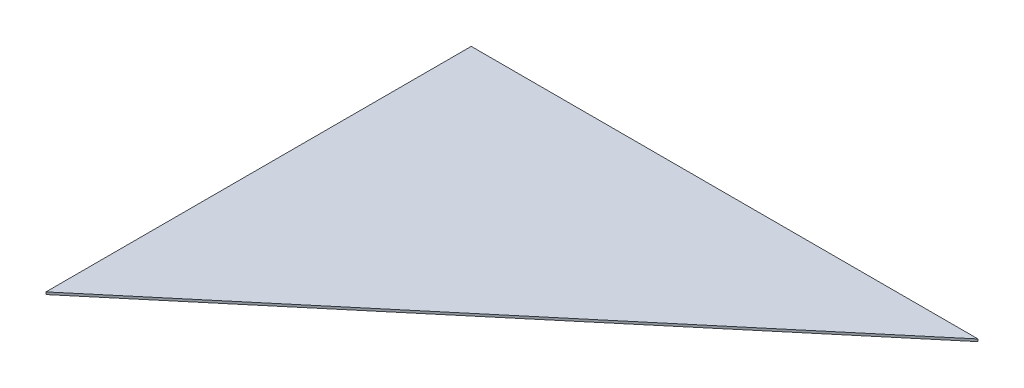
ISO-10303-21;
HEADER;
FILE_DESCRIPTION(('STEP AP214'),'2;1');
FILE_NAME('part.step','',(''),(''),'','','');
FILE_SCHEMA(('AUTOMOTIVE_DESIGN { 1 0 10303 214 1 1 1 1 }'));
ENDSEC;
DATA;
#1=APPLICATION_CONTEXT('core data for automotive mechanical design processes');
#2=APPLICATION_PROTOCOL_DEFINITION('international standard','automotive_design',2000,#1);
#3=PRODUCT_CONTEXT('',#1,'mechanical');
#4=PRODUCT('Part','Part','',(#3));
#5=PRODUCT_RELATED_PRODUCT_CATEGORY('part','',(#4));
#6=PRODUCT_DEFINITION_FORMATION('','',#4);
#7=PRODUCT_DEFINITION_CONTEXT('part definition',#1,'design');
#8=PRODUCT_DEFINITION('design','',#6,#7);
#9=PRODUCT_DEFINITION_SHAPE('','',#8);
#10=(LENGTH_UNIT() NAMED_UNIT(*) SI_UNIT(.MILLI.,.METRE.));
#11=(NAMED_UNIT(*) PLANE_ANGLE_UNIT() SI_UNIT($,.RADIAN.));
#12=(NAMED_UNIT(*) SI_UNIT($,.STERADIAN.) SOLID_ANGLE_UNIT());
#13=UNCERTAINTY_MEASURE_WITH_UNIT(LENGTH_MEASURE(1.E-05),#10,'distance_accuracy_value','');
#14=(GEOMETRIC_REPRESENTATION_CONTEXT(3) GLOBAL_UNCERTAINTY_ASSIGNED_CONTEXT((#13)) GLOBAL_UNIT_ASSIGNED_CONTEXT((#10,
#11,#12)) REPRESENTATION_CONTEXT('',''));
#15=CARTESIAN_POINT('',(0.,0.,0.));
#16=DIRECTION('',(0.,0.,1.));
#17=DIRECTION('',(1.,0.,0.));
#18=AXIS2_PLACEMENT_3D('',#15,#16,#17);
#19=CARTESIAN_POINT('',(553.75474691391,-6.35,574.675));
#20=DIRECTION('',(-1.,0.,0.));
#21=DIRECTION('',(0.,0.,1.));
#22=AXIS2_PLACEMENT_3D('',#19,#20,#21);
#23=PLANE('',#22);
#24=DIRECTION('',(0.,0.,1.));
#25=VECTOR('',#24,1.);
#26=CARTESIAN_POINT('',(553.75474691391,0.,574.675));
#27=LINE('',#26,#25);
#28=CARTESIAN_POINT('',(553.75474691391,0.,0.));
#29=VERTEX_POINT('',#28);
#30=CARTESIAN_POINT('',(553.75474691391,0.,1149.35));
#31=VERTEX_POINT('',#30);
#32=EDGE_CURVE('E60',#29,#31,#27,.T.);
#33=ORIENTED_EDGE('',*,*,#32,.F.);
#34=DIRECTION('',(0.,1.,0.));
#35=VECTOR('',#34,1.);
#36=CARTESIAN_POINT('',(553.75474691391,-6.35,0.));
#37=LINE('',#36,#35);
#38=CARTESIAN_POINT('',(553.75474691391,-6.35,0.));
#39=VERTEX_POINT('',#38);
#40=EDGE_CURVE('E9',#39,#29,#37,.T.);
#41=ORIENTED_EDGE('',*,*,#40,.F.);
#42=DIRECTION('',(0.,0.,1.));
#43=VECTOR('',#42,1.);
#44=CARTESIAN_POINT('',(553.75474691391,-6.35,574.675));
#45=LINE('',#44,#43);
#46=CARTESIAN_POINT('',(553.75474691391,-6.35,1149.35));
#47=VERTEX_POINT('',#46);
#48=EDGE_CURVE('E58',#39,#47,#45,.T.);
#49=ORIENTED_EDGE('',*,*,#48,.T.);
#50=DIRECTION('',(0.,1.,0.));
#51=VECTOR('',#50,1.);
#52=CARTESIAN_POINT('',(553.75474691391,-6.35,1149.35));
#53=LINE('',#52,#51);
#54=EDGE_CURVE('E36',#47,#31,#53,.T.);
#55=ORIENTED_EDGE('',*,*,#54,.T.);
#56=EDGE_LOOP('',(#33,#41,#49,#55));
#57=FACE_BOUND('',#56,.T.);
#58=ADVANCED_FACE('F14',(#57),#23,.T.);
#59=CARTESIAN_POINT('',(1238.62574273799,-6.35,0.));
#60=DIRECTION('',(0.,0.,-1.));
#61=DIRECTION('',(-1.,0.,0.));
#62=AXIS2_PLACEMENT_3D('',#59,#60,#61);
#63=PLANE('',#62);
#64=DIRECTION('',(-1.,0.,0.));
#65=VECTOR('',#64,1.);
#66=CARTESIAN_POINT('',(1238.62574273799,0.,0.));
#67=LINE('',#66,#65);
#68=CARTESIAN_POINT('',(1923.49673856207,0.,-2.20388805938073E-13));
#69=VERTEX_POINT('',#68);
#70=EDGE_CURVE('E83',#69,#29,#67,.T.);
#71=ORIENTED_EDGE('',*,*,#70,.F.);
#72=DIRECTION('',(0.,1.,0.));
#73=VECTOR('',#72,1.);
#74=CARTESIAN_POINT('',(1923.49673856207,-6.35,-2.20388805938073E-13));
#75=LINE('',#74,#73);
#76=CARTESIAN_POINT('',(1923.49673856207,-6.35,-2.20388805938073E-13));
#77=VERTEX_POINT('',#76);
#78=EDGE_CURVE('E23',#77,#69,#75,.T.);
#79=ORIENTED_EDGE('',*,*,#78,.F.);
#80=DIRECTION('',(-1.,0.,0.));
#81=VECTOR('',#80,1.);
#82=CARTESIAN_POINT('',(1238.62574273799,-6.35,0.));
#83=LINE('',#82,#81);
#84=EDGE_CURVE('E67',#77,#39,#83,.T.);
#85=ORIENTED_EDGE('',*,*,#84,.T.);
#86=ORIENTED_EDGE('',*,*,#40,.T.);
#87=EDGE_LOOP('',(#71,#79,#85,#86));
#88=FACE_BOUND('',#87,.T.);
#89=ADVANCED_FACE('F72',(#88),#63,.T.);
#90=CARTESIAN_POINT('',(1238.62574273799,-6.35,574.675));
#91=DIRECTION('',(0.642787609686539,0.,0.766044443118978));
#92=DIRECTION('',(0.766044443118978,0.,-0.642787609686539));
#93=AXIS2_PLACEMENT_3D('',#90,#91,#92);
#94=PLANE('',#93);
#95=DIRECTION('',(0.766044443118978,0.,-0.642787609686539));
#96=VECTOR('',#95,1.);
#97=CARTESIAN_POINT('',(1238.62574273799,0.,574.675));
#98=LINE('',#97,#96);
#99=EDGE_CURVE('E70',#31,#69,#98,.T.);
#100=ORIENTED_EDGE('',*,*,#99,.F.);
#101=ORIENTED_EDGE('',*,*,#54,.F.);
#102=DIRECTION('',(0.766044443118978,0.,-0.642787609686539));
#103=VECTOR('',#102,1.);
#104=CARTESIAN_POINT('',(1238.62574273799,-6.35,574.675));
#105=LINE('',#104,#103);
#106=EDGE_CURVE('E68',#47,#77,#105,.T.);
#107=ORIENTED_EDGE('',*,*,#106,.T.);
#108=ORIENTED_EDGE('',*,*,#78,.T.);
#109=EDGE_LOOP('',(#100,#101,#107,#108));
#110=FACE_BOUND('',#109,.T.);
#111=ADVANCED_FACE('F103',(#110),#94,.T.);
#112=CARTESIAN_POINT('',(1238.62574273799,-6.35,574.675));
#113=DIRECTION('',(0.,-1.,0.));
#114=DIRECTION('',(1.,0.,0.));
#115=AXIS2_PLACEMENT_3D('',#112,#113,#114);
#116=PLANE('',#115);
#117=ORIENTED_EDGE('',*,*,#48,.F.);
#118=ORIENTED_EDGE('',*,*,#84,.F.);
#119=ORIENTED_EDGE('',*,*,#106,.F.);
#120=EDGE_LOOP('',(#117,#118,#119));
#121=FACE_BOUND('',#120,.T.);
#122=ADVANCED_FACE('F66',(#121),#116,.T.);
#123=CARTESIAN_POINT('',(1238.62574273799,0.,574.675));
#124=DIRECTION('',(0.,-1.,0.));
#125=DIRECTION('',(1.,0.,0.));
#126=AXIS2_PLACEMENT_3D('',#123,#124,#125);
#127=PLANE('',#126);
#128=ORIENTED_EDGE('',*,*,#32,.T.);
#129=ORIENTED_EDGE('',*,*,#99,.T.);
#130=ORIENTED_EDGE('',*,*,#70,.T.);
#131=EDGE_LOOP('',(#128,#129,#130));
#132=FACE_BOUND('',#131,.T.);
#133=ADVANCED_FACE('F102',(#132),#127,.F.);
#134=CLOSED_SHELL('',(#58,#89,#111,#122,#133));
#135=MANIFOLD_SOLID_BREP('B1',#134);
#136=ADVANCED_BREP_SHAPE_REPRESENTATION('',(#18,#135),#14);
#137=SHAPE_DEFINITION_REPRESENTATION(#9,#136);
ENDSEC;
END-ISO-10303-21;
